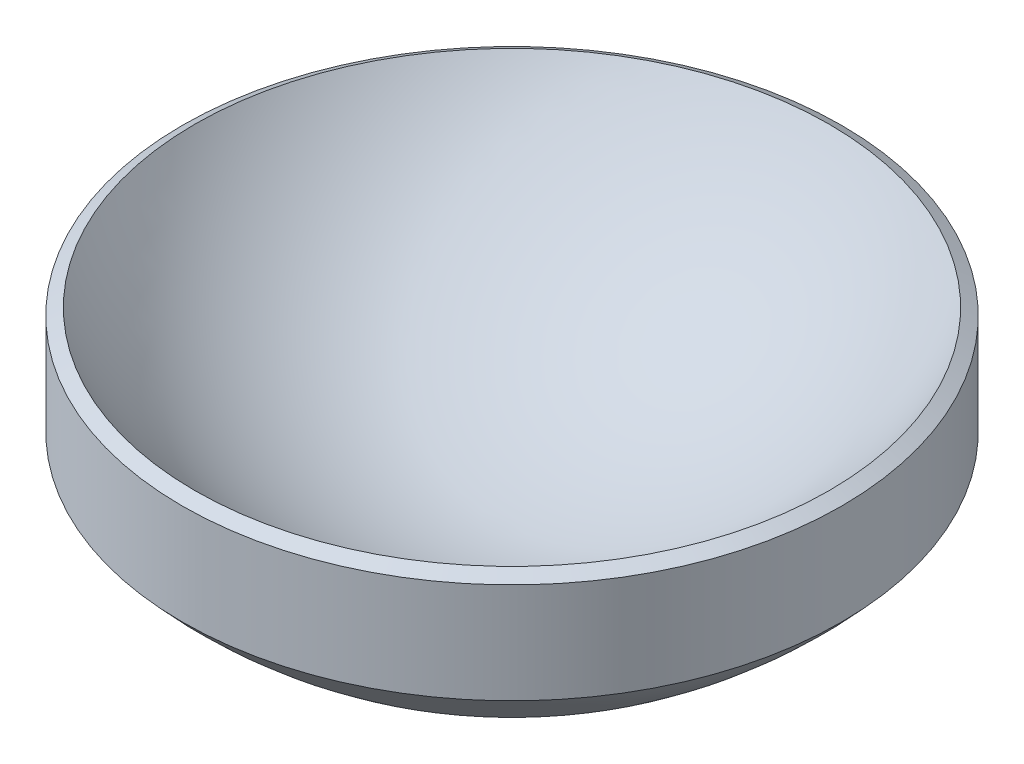
ISO-10303-21;
HEADER;
FILE_DESCRIPTION(('STEP AP214'),'2;1');
FILE_NAME('part.step','',(''),(''),'','','');
FILE_SCHEMA(('AUTOMOTIVE_DESIGN { 1 0 10303 214 1 1 1 1 }'));
ENDSEC;
DATA;
#1=APPLICATION_CONTEXT('core data for automotive mechanical design processes');
#2=APPLICATION_PROTOCOL_DEFINITION('international standard','automotive_design',2000,#1);
#3=PRODUCT_CONTEXT('',#1,'mechanical');
#4=PRODUCT('Part','Part','',(#3));
#5=PRODUCT_RELATED_PRODUCT_CATEGORY('part','',(#4));
#6=PRODUCT_DEFINITION_FORMATION('','',#4);
#7=PRODUCT_DEFINITION_CONTEXT('part definition',#1,'design');
#8=PRODUCT_DEFINITION('design','',#6,#7);
#9=PRODUCT_DEFINITION_SHAPE('','',#8);
#10=(LENGTH_UNIT() NAMED_UNIT(*) SI_UNIT(.MILLI.,.METRE.));
#11=(NAMED_UNIT(*) PLANE_ANGLE_UNIT() SI_UNIT($,.RADIAN.));
#12=(NAMED_UNIT(*) SI_UNIT($,.STERADIAN.) SOLID_ANGLE_UNIT());
#13=UNCERTAINTY_MEASURE_WITH_UNIT(LENGTH_MEASURE(1.E-05),#10,'distance_accuracy_value','');
#14=(GEOMETRIC_REPRESENTATION_CONTEXT(3) GLOBAL_UNCERTAINTY_ASSIGNED_CONTEXT((#13)) GLOBAL_UNIT_ASSIGNED_CONTEXT((#10,
#11,#12)) REPRESENTATION_CONTEXT('',''));
#15=CARTESIAN_POINT('',(0.,0.,0.));
#16=DIRECTION('',(0.,0.,1.));
#17=DIRECTION('',(1.,0.,0.));
#18=AXIS2_PLACEMENT_3D('',#15,#16,#17);
#19=CARTESIAN_POINT('',(0.,5.,0.));
#20=DIRECTION('',(0.,1.,0.));
#21=DIRECTION('',(-1.,0.,0.));
#22=AXIS2_PLACEMENT_3D('',#19,#20,#21);
#23=SPHERICAL_SURFACE('',#22,5.);
#24=CARTESIAN_POINT('',(0.,2.5,0.));
#25=DIRECTION('',(0.,1.,0.));
#26=DIRECTION('',(-1.,0.,0.));
#27=AXIS2_PLACEMENT_3D('',#24,#25,#26);
#28=CIRCLE('',#27,4.33012701892219);
#29=CARTESIAN_POINT('',(-4.33012701892219,2.5,0.));
#30=VERTEX_POINT('',#29);
#31=EDGE_CURVE('E10',#30,#30,#28,.T.);
#32=ORIENTED_EDGE('',*,*,#31,.T.);
#33=EDGE_LOOP('',(#32));
#34=FACE_BOUND('',#33,.T.);
#35=ADVANCED_FACE('F31',(#34),#23,.F.);
#36=CARTESIAN_POINT('',(0.,2.,0.));
#37=DIRECTION('',(0.,-1.,0.));
#38=DIRECTION('',(1.,0.,0.));
#39=AXIS2_PLACEMENT_3D('',#36,#37,#38);
#40=CONICAL_SURFACE('',#39,5.19615242270663,1.0471975511966);
#41=CARTESIAN_POINT('',(0.,2.40192378864669,0.));
#42=DIRECTION('',(0.,-1.,0.));
#43=DIRECTION('',(1.,0.,0.));
#44=AXIS2_PLACEMENT_3D('',#41,#42,#43);
#45=CIRCLE('',#44,4.5);
#46=CARTESIAN_POINT('',(4.5,2.40192378864669,0.));
#47=VERTEX_POINT('',#46);
#48=EDGE_CURVE('E38',#47,#47,#45,.F.);
#49=ORIENTED_EDGE('',*,*,#48,.T.);
#50=EDGE_LOOP('',(#49));
#51=FACE_BOUND('',#50,.T.);
#52=ORIENTED_EDGE('',*,*,#31,.F.);
#53=EDGE_LOOP('',(#52));
#54=FACE_BOUND('',#53,.T.);
#55=ADVANCED_FACE('F63',(#51,#54),#40,.T.);
#56=CARTESIAN_POINT('',(0.,0.,0.));
#57=DIRECTION('',(0.,-1.,0.));
#58=DIRECTION('',(1.,0.,0.));
#59=AXIS2_PLACEMENT_3D('',#56,#57,#58);
#60=CYLINDRICAL_SURFACE('',#59,4.5);
#61=CARTESIAN_POINT('',(0.,1.03137303340311,0.));
#62=DIRECTION('',(0.,1.,0.));
#63=DIRECTION('',(-1.,0.,0.));
#64=AXIS2_PLACEMENT_3D('',#61,#62,#63);
#65=CIRCLE('',#64,4.5);
#66=CARTESIAN_POINT('',(-4.5,1.03137303340311,0.));
#67=VERTEX_POINT('',#66);
#68=EDGE_CURVE('E43',#67,#67,#65,.T.);
#69=ORIENTED_EDGE('',*,*,#68,.T.);
#70=EDGE_LOOP('',(#69));
#71=FACE_BOUND('',#70,.T.);
#72=ORIENTED_EDGE('',*,*,#48,.F.);
#73=EDGE_LOOP('',(#72));
#74=FACE_BOUND('',#73,.T.);
#75=ADVANCED_FACE('F56',(#71,#74),#60,.T.);
#76=CARTESIAN_POINT('',(0.,5.,0.));
#77=DIRECTION('',(0.,1.,0.));
#78=DIRECTION('',(-1.,0.,0.));
#79=AXIS2_PLACEMENT_3D('',#76,#77,#78);
#80=SPHERICAL_SURFACE('',#79,6.);
#81=CARTESIAN_POINT('',(0.,-0.7,0.));
#82=DIRECTION('',(0.,1.,0.));
#83=DIRECTION('',(-1.,0.,0.));
#84=AXIS2_PLACEMENT_3D('',#81,#82,#83);
#85=CIRCLE('',#84,1.87349939951952);
#86=CARTESIAN_POINT('',(-1.87349939951952,-0.7,0.));
#87=VERTEX_POINT('',#86);
#88=EDGE_CURVE('E34',#87,#87,#85,.F.);
#89=ORIENTED_EDGE('',*,*,#88,.F.);
#90=EDGE_LOOP('',(#89));
#91=FACE_BOUND('',#90,.T.);
#92=ORIENTED_EDGE('',*,*,#68,.F.);
#93=EDGE_LOOP('',(#92));
#94=FACE_BOUND('',#93,.T.);
#95=ADVANCED_FACE('F53',(#91,#94),#80,.T.);
#96=CARTESIAN_POINT('',(-6.12500649904122,-0.7,-4.5));
#97=DIRECTION('',(0.,1.,0.));
#98=DIRECTION('',(-1.,0.,0.));
#99=AXIS2_PLACEMENT_3D('',#96,#97,#98);
#100=PLANE('',#99);
#101=ORIENTED_EDGE('',*,*,#88,.T.);
#102=EDGE_LOOP('',(#101));
#103=FACE_BOUND('',#102,.T.);
#104=ADVANCED_FACE('F51',(#103),#100,.F.);
#105=CLOSED_SHELL('',(#35,#55,#75,#95,#104));
#106=MANIFOLD_SOLID_BREP('B2',#105);
#107=ADVANCED_BREP_SHAPE_REPRESENTATION('',(#18,#106),#14);
#108=SHAPE_DEFINITION_REPRESENTATION(#9,#107);
ENDSEC;
END-ISO-10303-21;
